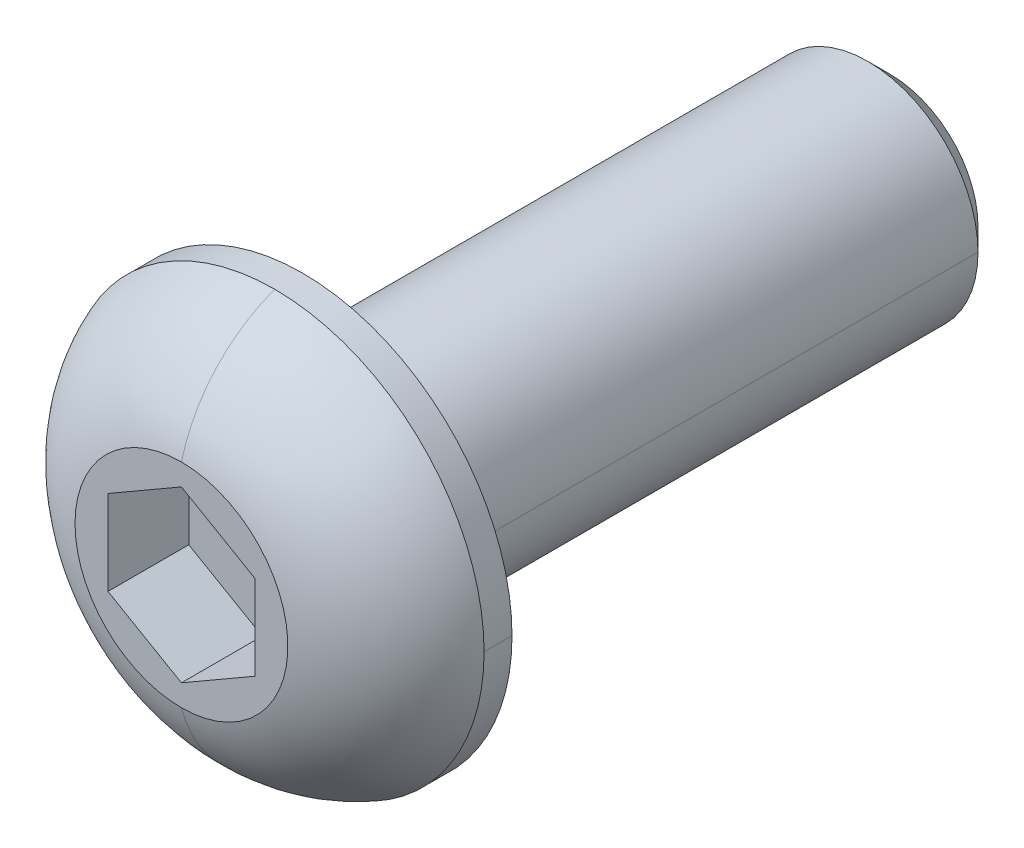
ISO-10303-21;
HEADER;
FILE_DESCRIPTION(('STEP AP214'),'2;1');
FILE_NAME('part.step','',(''),(''),'','','');
FILE_SCHEMA(('AUTOMOTIVE_DESIGN { 1 0 10303 214 1 1 1 1 }'));
ENDSEC;
DATA;
#1=APPLICATION_CONTEXT('core data for automotive mechanical design processes');
#2=APPLICATION_PROTOCOL_DEFINITION('international standard','automotive_design',2000,#1);
#3=PRODUCT_CONTEXT('',#1,'mechanical');
#4=PRODUCT('Part','Part','',(#3));
#5=PRODUCT_RELATED_PRODUCT_CATEGORY('part','',(#4));
#6=PRODUCT_DEFINITION_FORMATION('','',#4);
#7=PRODUCT_DEFINITION_CONTEXT('part definition',#1,'design');
#8=PRODUCT_DEFINITION('design','',#6,#7);
#9=PRODUCT_DEFINITION_SHAPE('','',#8);
#10=(LENGTH_UNIT() NAMED_UNIT(*) SI_UNIT(.MILLI.,.METRE.));
#11=(NAMED_UNIT(*) PLANE_ANGLE_UNIT() SI_UNIT($,.RADIAN.));
#12=(NAMED_UNIT(*) SI_UNIT($,.STERADIAN.) SOLID_ANGLE_UNIT());
#13=UNCERTAINTY_MEASURE_WITH_UNIT(LENGTH_MEASURE(1.E-05),#10,'distance_accuracy_value','');
#14=(GEOMETRIC_REPRESENTATION_CONTEXT(3) GLOBAL_UNCERTAINTY_ASSIGNED_CONTEXT((#13)) GLOBAL_UNIT_ASSIGNED_CONTEXT((#10,
#11,#12)) REPRESENTATION_CONTEXT('',''));
#15=CARTESIAN_POINT('',(0.,0.,0.));
#16=DIRECTION('',(0.,0.,1.));
#17=DIRECTION('',(1.,0.,0.));
#18=AXIS2_PLACEMENT_3D('',#15,#16,#17);
#19=CARTESIAN_POINT('',(0.,0.,1.05115163103287));
#20=DIRECTION('',(0.,0.,-1.));
#21=DIRECTION('',(-1.,0.,0.));
#22=AXIS2_PLACEMENT_3D('',#19,#20,#21);
#23=CYLINDRICAL_SURFACE('',#22,3.79999999998519);
#24=DIRECTION('',(0.,0.,-1.));
#25=VECTOR('',#24,1.);
#26=CARTESIAN_POINT('',(-3.79999999998519,0.,1.05115163103287));
#27=LINE('',#26,#25);
#28=CARTESIAN_POINT('',(-3.79999999997037,0.,1.3044849643733));
#29=VERTEX_POINT('',#28);
#30=CARTESIAN_POINT('',(-3.8,0.,0.797818297692444));
#31=VERTEX_POINT('',#30);
#32=EDGE_CURVE('E54',#29,#31,#27,.T.);
#33=ORIENTED_EDGE('',*,*,#32,.F.);
#34=CARTESIAN_POINT('',(0.,0.,1.3044849643733));
#35=DIRECTION('',(0.,0.,-1.));
#36=DIRECTION('',(-1.,0.,0.));
#37=AXIS2_PLACEMENT_3D('',#34,#35,#36);
#38=CIRCLE('',#37,3.79999999997037);
#39=CARTESIAN_POINT('',(0.,3.79999999997037,1.3044849643733));
#40=VERTEX_POINT('',#39);
#41=EDGE_CURVE('E11',#29,#40,#38,.T.);
#42=ORIENTED_EDGE('',*,*,#41,.T.);
#43=CARTESIAN_POINT('',(0.,0.,1.3044849643733));
#44=DIRECTION('',(0.,0.,-1.));
#45=DIRECTION('',(-1.,0.,0.));
#46=AXIS2_PLACEMENT_3D('',#43,#44,#45);
#47=CIRCLE('',#46,3.79999999997037);
#48=CARTESIAN_POINT('',(3.79999999997037,0.,1.3044849643733));
#49=VERTEX_POINT('',#48);
#50=EDGE_CURVE('E46',#40,#49,#47,.T.);
#51=ORIENTED_EDGE('',*,*,#50,.T.);
#52=DIRECTION('',(0.,0.,1.));
#53=VECTOR('',#52,1.);
#54=CARTESIAN_POINT('',(3.79999999998519,0.,1.05115163103287));
#55=LINE('',#54,#53);
#56=CARTESIAN_POINT('',(3.8,0.,0.797818297692445));
#57=VERTEX_POINT('',#56);
#58=EDGE_CURVE('E143',#57,#49,#55,.T.);
#59=ORIENTED_EDGE('',*,*,#58,.F.);
#60=CARTESIAN_POINT('',(0.,0.,0.797818297692445));
#61=DIRECTION('',(0.,0.,-1.));
#62=DIRECTION('',(-1.,0.,0.));
#63=AXIS2_PLACEMENT_3D('',#60,#61,#62);
#64=CIRCLE('',#63,3.8);
#65=EDGE_CURVE('E214',#31,#57,#64,.T.);
#66=ORIENTED_EDGE('',*,*,#65,.F.);
#67=EDGE_LOOP('',(#33,#42,#51,#59,#66));
#68=FACE_BOUND('',#67,.T.);
#69=ADVANCED_FACE('F36',(#68),#23,.T.);
#70=CARTESIAN_POINT('',(0.,0.,0.380310152090413));
#71=DIRECTION('',(0.,0.,-1.));
#72=DIRECTION('',(0.,-1.,0.));
#73=AXIS2_PLACEMENT_3D('',#70,#71,#72);
#74=DEGENERATE_TOROIDAL_SURFACE('',#73,1.26085057159698,2.7021063826702,.T.);
#75=CARTESIAN_POINT('',(0.,-1.26085057159698,0.380310152090413));
#76=DIRECTION('',(1.,0.,0.));
#77=DIRECTION('',(0.,-1.,0.));
#78=AXIS2_PLACEMENT_3D('',#75,#76,#77);
#79=CIRCLE('',#78,2.7021063826702);
#80=CARTESIAN_POINT('',(0.,-1.93169333333333,2.99781829769244));
#81=VERTEX_POINT('',#80);
#82=CARTESIAN_POINT('',(0.,-3.79999999997037,1.3044849643733));
#83=VERTEX_POINT('',#82);
#84=EDGE_CURVE('E198',#81,#83,#79,.T.);
#85=ORIENTED_EDGE('',*,*,#84,.F.);
#86=CARTESIAN_POINT('',(0.,0.,2.99781829769244));
#87=DIRECTION('',(0.,0.,-1.));
#88=DIRECTION('',(-1.,0.,0.));
#89=AXIS2_PLACEMENT_3D('',#86,#87,#88);
#90=CIRCLE('',#89,1.93169333333333);
#91=CARTESIAN_POINT('',(-1.93169333333333,0.,2.99781829769244));
#92=VERTEX_POINT('',#91);
#93=EDGE_CURVE('E208',#81,#92,#90,.T.);
#94=ORIENTED_EDGE('',*,*,#93,.T.);
#95=CARTESIAN_POINT('',(0.,0.,2.99781829769244));
#96=DIRECTION('',(0.,0.,-1.));
#97=DIRECTION('',(-1.,0.,0.));
#98=AXIS2_PLACEMENT_3D('',#95,#96,#97);
#99=CIRCLE('',#98,1.93169333333333);
#100=CARTESIAN_POINT('',(0.,1.93169333333333,2.99781829769244));
#101=VERTEX_POINT('',#100);
#102=EDGE_CURVE('E189',#92,#101,#99,.T.);
#103=ORIENTED_EDGE('',*,*,#102,.T.);
#104=CARTESIAN_POINT('',(0.,1.26085057159698,0.380310152090413));
#105=DIRECTION('',(1.,0.,0.));
#106=DIRECTION('',(0.,1.,0.));
#107=AXIS2_PLACEMENT_3D('',#104,#105,#106);
#108=CIRCLE('',#107,2.7021063826702);
#109=EDGE_CURVE('E226',#40,#101,#108,.T.);
#110=ORIENTED_EDGE('',*,*,#109,.F.);
#111=ORIENTED_EDGE('',*,*,#41,.F.);
#112=CARTESIAN_POINT('',(0.,0.,1.3044849643733));
#113=DIRECTION('',(0.,0.,-1.));
#114=DIRECTION('',(-1.,0.,0.));
#115=AXIS2_PLACEMENT_3D('',#112,#113,#114);
#116=CIRCLE('',#115,3.79999999997037);
#117=EDGE_CURVE('E223',#83,#29,#116,.T.);
#118=ORIENTED_EDGE('',*,*,#117,.F.);
#119=EDGE_LOOP('',(#85,#94,#103,#110,#111,#118));
#120=FACE_BOUND('',#119,.T.);
#121=ADVANCED_FACE('F307',(#120),#74,.T.);
#122=CARTESIAN_POINT('',(0.,0.,-9.66438170230755));
#123=DIRECTION('',(0.,0.,1.));
#124=DIRECTION('',(-1.,0.,0.));
#125=AXIS2_PLACEMENT_3D('',#122,#123,#124);
#126=CONICAL_SURFACE('',#125,1.79553333333333,0.785398163397448);
#127=DIRECTION('',(0.707106781186547,0.,-0.707106781186548));
#128=VECTOR('',#127,1.);
#129=CARTESIAN_POINT('',(-1.79553333333333,0.,-9.66438170230755));
#130=LINE('',#129,#128);
#131=CARTESIAN_POINT('',(-2.,0.,-9.45991503564089));
#132=VERTEX_POINT('',#131);
#133=CARTESIAN_POINT('',(-1.59106666666667,0.,-9.86884836897422));
#134=VERTEX_POINT('',#133);
#135=EDGE_CURVE('E195',#132,#134,#130,.T.);
#136=ORIENTED_EDGE('',*,*,#135,.F.);
#137=CARTESIAN_POINT('',(0.,0.,-9.45991503564089));
#138=DIRECTION('',(0.,0.,-1.));
#139=DIRECTION('',(-1.,0.,0.));
#140=AXIS2_PLACEMENT_3D('',#137,#138,#139);
#141=CIRCLE('',#140,2.);
#142=CARTESIAN_POINT('',(2.,0.,-9.45991503564089));
#143=VERTEX_POINT('',#142);
#144=EDGE_CURVE('E186',#132,#143,#141,.T.);
#145=ORIENTED_EDGE('',*,*,#144,.T.);
#146=DIRECTION('',(0.707106781186547,0.,0.707106781186548));
#147=VECTOR('',#146,1.);
#148=CARTESIAN_POINT('',(1.79553333333333,0.,-9.66438170230755));
#149=LINE('',#148,#147);
#150=CARTESIAN_POINT('',(1.59106666666667,0.,-9.86884836897422));
#151=VERTEX_POINT('',#150);
#152=EDGE_CURVE('E219',#151,#143,#149,.T.);
#153=ORIENTED_EDGE('',*,*,#152,.F.);
#154=CARTESIAN_POINT('',(0.,0.,-9.86884836897422));
#155=DIRECTION('',(0.,0.,-1.));
#156=DIRECTION('',(-1.,0.,0.));
#157=AXIS2_PLACEMENT_3D('',#154,#155,#156);
#158=CIRCLE('',#157,1.59106666666667);
#159=EDGE_CURVE('E220',#134,#151,#158,.T.);
#160=ORIENTED_EDGE('',*,*,#159,.F.);
#161=EDGE_LOOP('',(#136,#145,#153,#160));
#162=FACE_BOUND('',#161,.T.);
#163=ADVANCED_FACE('F327',(#162),#126,.T.);
#164=CARTESIAN_POINT('',(0.,0.,-4.39771503564089));
#165=DIRECTION('',(0.,0.,-1.));
#166=DIRECTION('',(-1.,0.,0.));
#167=AXIS2_PLACEMENT_3D('',#164,#165,#166);
#168=CYLINDRICAL_SURFACE('',#167,2.);
#169=DIRECTION('',(0.,0.,-1.));
#170=VECTOR('',#169,1.);
#171=CARTESIAN_POINT('',(-2.,0.,-4.39771503564089));
#172=LINE('',#171,#170);
#173=CARTESIAN_POINT('',(-2.,0.,0.664484964359111));
#174=VERTEX_POINT('',#173);
#175=EDGE_CURVE('E249',#174,#132,#172,.T.);
#176=ORIENTED_EDGE('',*,*,#175,.F.);
#177=CARTESIAN_POINT('',(0.,0.,0.664484964359111));
#178=DIRECTION('',(0.,0.,-1.));
#179=DIRECTION('',(-1.,0.,0.));
#180=AXIS2_PLACEMENT_3D('',#177,#178,#179);
#181=CIRCLE('',#180,2.);
#182=CARTESIAN_POINT('',(0.,2.,0.664484964359111));
#183=VERTEX_POINT('',#182);
#184=EDGE_CURVE('E190',#174,#183,#181,.T.);
#185=ORIENTED_EDGE('',*,*,#184,.T.);
#186=CARTESIAN_POINT('',(0.,0.,0.664484964359111));
#187=DIRECTION('',(0.,0.,-1.));
#188=DIRECTION('',(-1.,0.,0.));
#189=AXIS2_PLACEMENT_3D('',#186,#187,#188);
#190=CIRCLE('',#189,2.);
#191=CARTESIAN_POINT('',(2.,0.,0.664484964359111));
#192=VERTEX_POINT('',#191);
#193=EDGE_CURVE('E40',#183,#192,#190,.T.);
#194=ORIENTED_EDGE('',*,*,#193,.T.);
#195=DIRECTION('',(0.,0.,1.));
#196=VECTOR('',#195,1.);
#197=CARTESIAN_POINT('',(2.,0.,-4.39771503564089));
#198=LINE('',#197,#196);
#199=EDGE_CURVE('E81',#143,#192,#198,.T.);
#200=ORIENTED_EDGE('',*,*,#199,.F.);
#201=ORIENTED_EDGE('',*,*,#144,.F.);
#202=EDGE_LOOP('',(#176,#185,#194,#200,#201));
#203=FACE_BOUND('',#202,.T.);
#204=ADVANCED_FACE('F334',(#203),#168,.T.);
#205=CARTESIAN_POINT('',(0.,0.,0.664484964359111));
#206=DIRECTION('',(0.,0.,-1.));
#207=DIRECTION('',(0.,-1.,0.));
#208=AXIS2_PLACEMENT_3D('',#205,#206,#207);
#209=TOROIDAL_SURFACE('',#208,2.13333333333333,0.133333333333333);
#210=CARTESIAN_POINT('',(0.,2.13333333333333,0.664484964359111));
#211=DIRECTION('',(1.,0.,0.));
#212=DIRECTION('',(0.,1.,0.));
#213=AXIS2_PLACEMENT_3D('',#210,#211,#212);
#214=CIRCLE('',#213,0.133333333333333);
#215=CARTESIAN_POINT('',(0.,2.13333333333333,0.797818297692445));
#216=VERTEX_POINT('',#215);
#217=EDGE_CURVE('E215',#216,#183,#214,.T.);
#218=ORIENTED_EDGE('',*,*,#217,.F.);
#219=CARTESIAN_POINT('',(0.,0.,0.797818297692445));
#220=DIRECTION('',(0.,0.,-1.));
#221=DIRECTION('',(-1.,0.,0.));
#222=AXIS2_PLACEMENT_3D('',#219,#220,#221);
#223=CIRCLE('',#222,2.13333333333333);
#224=CARTESIAN_POINT('',(0.,-2.13333333333333,0.797818297692445));
#225=VERTEX_POINT('',#224);
#226=EDGE_CURVE('E262',#216,#225,#223,.T.);
#227=ORIENTED_EDGE('',*,*,#226,.T.);
#228=CARTESIAN_POINT('',(0.,-2.13333333333333,0.664484964359111));
#229=DIRECTION('',(1.,0.,0.));
#230=DIRECTION('',(0.,-1.,0.));
#231=AXIS2_PLACEMENT_3D('',#228,#229,#230);
#232=CIRCLE('',#231,0.133333333333333);
#233=CARTESIAN_POINT('',(0.,-2.,0.664484964359111));
#234=VERTEX_POINT('',#233);
#235=EDGE_CURVE('E183',#234,#225,#232,.T.);
#236=ORIENTED_EDGE('',*,*,#235,.F.);
#237=CARTESIAN_POINT('',(0.,0.,0.664484964359111));
#238=DIRECTION('',(0.,0.,-1.));
#239=DIRECTION('',(-1.,0.,0.));
#240=AXIS2_PLACEMENT_3D('',#237,#238,#239);
#241=CIRCLE('',#240,2.);
#242=EDGE_CURVE('E194',#192,#234,#241,.T.);
#243=ORIENTED_EDGE('',*,*,#242,.F.);
#244=ORIENTED_EDGE('',*,*,#193,.F.);
#245=EDGE_LOOP('',(#218,#227,#236,#243,#244));
#246=FACE_BOUND('',#245,.T.);
#247=ADVANCED_FACE('F349',(#246),#209,.F.);
#248=CARTESIAN_POINT('',(1.33333333333333,0.384900179466667,2.99781829769244));
#249=DIRECTION('',(1.,0.,0.));
#250=DIRECTION('',(0.,1.,0.));
#251=AXIS2_PLACEMENT_3D('',#248,#249,#250);
#252=PLANE('',#251);
#253=DIRECTION('',(0.,1.,0.));
#254=VECTOR('',#253,1.);
#255=CARTESIAN_POINT('',(1.33333333333333,0.,1.53115163102578));
#256=LINE('',#255,#254);
#257=CARTESIAN_POINT('',(1.33333333333333,-0.769800358933333,1.53115163102578));
#258=VERTEX_POINT('',#257);
#259=CARTESIAN_POINT('',(1.33333333333333,0.769800358933333,1.53115163102578));
#260=VERTEX_POINT('',#259);
#261=EDGE_CURVE('E169',#258,#260,#256,.T.);
#262=ORIENTED_EDGE('',*,*,#261,.F.);
#263=DIRECTION('',(0.,0.,-1.));
#264=VECTOR('',#263,1.);
#265=CARTESIAN_POINT('',(1.33333333333333,-0.769800358933333,2.99781829769244));
#266=LINE('',#265,#264);
#267=CARTESIAN_POINT('',(1.33333333333333,-0.769800358933333,2.99781829769244));
#268=VERTEX_POINT('',#267);
#269=EDGE_CURVE('E168',#268,#258,#266,.T.);
#270=ORIENTED_EDGE('',*,*,#269,.F.);
#271=DIRECTION('',(0.,-1.,0.));
#272=VECTOR('',#271,1.);
#273=CARTESIAN_POINT('',(1.33333333333333,0.192450089733333,2.99781829769244));
#274=LINE('',#273,#272);
#275=CARTESIAN_POINT('',(1.33333333333333,0.769800358933333,2.99781829769244));
#276=VERTEX_POINT('',#275);
#277=EDGE_CURVE('E157',#276,#268,#274,.T.);
#278=ORIENTED_EDGE('',*,*,#277,.F.);
#279=DIRECTION('',(0.,0.,-1.));
#280=VECTOR('',#279,1.);
#281=CARTESIAN_POINT('',(1.33333333333333,0.769800358933333,2.99781829769244));
#282=LINE('',#281,#280);
#283=EDGE_CURVE('E260',#276,#260,#282,.T.);
#284=ORIENTED_EDGE('',*,*,#283,.T.);
#285=EDGE_LOOP('',(#262,#270,#278,#284));
#286=FACE_BOUND('',#285,.T.);
#287=ADVANCED_FACE('F38',(#286),#252,.F.);
#288=CARTESIAN_POINT('',(0.666666666666667,1.1547005384,2.99781829769244));
#289=DIRECTION('',(0.500000000006738,0.866025403780548,0.));
#290=DIRECTION('',(0.,0.,-1.));
#291=AXIS2_PLACEMENT_3D('',#288,#289,#290);
#292=PLANE('',#291);
#293=DIRECTION('',(-0.866025403780548,0.500000000006738,0.));
#294=VECTOR('',#293,1.);
#295=CARTESIAN_POINT('',(0.,1.53960071786667,1.53115163102578));
#296=LINE('',#295,#294);
#297=CARTESIAN_POINT('',(0.,1.53960071786667,1.53115163102578));
#298=VERTEX_POINT('',#297);
#299=EDGE_CURVE('E116',#260,#298,#296,.T.);
#300=ORIENTED_EDGE('',*,*,#299,.F.);
#301=ORIENTED_EDGE('',*,*,#283,.F.);
#302=DIRECTION('',(0.866025403780548,-0.500000000006738,0.));
#303=VECTOR('',#302,1.);
#304=CARTESIAN_POINT('',(0.0169741666814883,1.52980067816367,2.99781829769244));
#305=LINE('',#304,#303);
#306=CARTESIAN_POINT('',(0.,1.53960071786667,2.99781829769244));
#307=VERTEX_POINT('',#306);
#308=EDGE_CURVE('E124',#307,#276,#305,.T.);
#309=ORIENTED_EDGE('',*,*,#308,.F.);
#310=DIRECTION('',(0.,0.,-1.));
#311=VECTOR('',#310,1.);
#312=CARTESIAN_POINT('',(0.,1.53960071786667,2.99781829769244));
#313=LINE('',#312,#311);
#314=EDGE_CURVE('E236',#307,#298,#313,.T.);
#315=ORIENTED_EDGE('',*,*,#314,.T.);
#316=EDGE_LOOP('',(#300,#301,#309,#315));
#317=FACE_BOUND('',#316,.T.);
#318=ADVANCED_FACE('F422',(#317),#292,.F.);
#319=CARTESIAN_POINT('',(-0.666666666666667,1.1547005384,2.99781829769244));
#320=DIRECTION('',(-0.500000000006738,0.866025403780548,0.));
#321=DIRECTION('',(0.,0.,1.));
#322=AXIS2_PLACEMENT_3D('',#319,#320,#321);
#323=PLANE('',#322);
#324=DIRECTION('',(-0.866025403780548,-0.500000000006738,0.));
#325=VECTOR('',#324,1.);
#326=CARTESIAN_POINT('',(-1.33333333333333,0.769800358933333,1.53115163102578));
#327=LINE('',#326,#325);
#328=CARTESIAN_POINT('',(-1.33333333333333,0.769800358933333,1.53115163102578));
#329=VERTEX_POINT('',#328);
#330=EDGE_CURVE('E200',#298,#329,#327,.T.);
#331=ORIENTED_EDGE('',*,*,#330,.F.);
#332=ORIENTED_EDGE('',*,*,#314,.F.);
#333=DIRECTION('',(0.866025403780548,0.500000000006738,0.));
#334=VECTOR('',#333,1.);
#335=CARTESIAN_POINT('',(-1.31635916666981,0.779600398625961,2.99781829769244));
#336=LINE('',#335,#334);
#337=CARTESIAN_POINT('',(-1.33333333333333,0.769800358933333,2.99781829769244));
#338=VERTEX_POINT('',#337);
#339=EDGE_CURVE('E197',#338,#307,#336,.T.);
#340=ORIENTED_EDGE('',*,*,#339,.F.);
#341=DIRECTION('',(0.,0.,-1.));
#342=VECTOR('',#341,1.);
#343=CARTESIAN_POINT('',(-1.33333333333333,0.769800358933333,2.99781829769244));
#344=LINE('',#343,#342);
#345=EDGE_CURVE('E238',#338,#329,#344,.T.);
#346=ORIENTED_EDGE('',*,*,#345,.T.);
#347=EDGE_LOOP('',(#331,#332,#340,#346));
#348=FACE_BOUND('',#347,.T.);
#349=ADVANCED_FACE('F415',(#348),#323,.F.);
#350=CARTESIAN_POINT('',(-1.33333333333333,0.,2.99781829769244));
#351=DIRECTION('',(-1.,0.,0.));
#352=DIRECTION('',(0.,0.,1.));
#353=AXIS2_PLACEMENT_3D('',#350,#351,#352);
#354=PLANE('',#353);
#355=DIRECTION('',(0.,-1.,0.));
#356=VECTOR('',#355,1.);
#357=CARTESIAN_POINT('',(-1.33333333333333,-0.769800358933333,1.53115163102578));
#358=LINE('',#357,#356);
#359=CARTESIAN_POINT('',(-1.33333333333333,-0.769800358933333,1.53115163102578));
#360=VERTEX_POINT('',#359);
#361=EDGE_CURVE('E201',#329,#360,#358,.T.);
#362=ORIENTED_EDGE('',*,*,#361,.F.);
#363=ORIENTED_EDGE('',*,*,#345,.F.);
#364=DIRECTION('',(0.,1.,0.));
#365=VECTOR('',#364,1.);
#366=CARTESIAN_POINT('',(-1.33333333333333,0.,2.99781829769244));
#367=LINE('',#366,#365);
#368=CARTESIAN_POINT('',(-1.33333333333333,-0.769800358933333,2.99781829769244));
#369=VERTEX_POINT('',#368);
#370=EDGE_CURVE('E180',#369,#338,#367,.T.);
#371=ORIENTED_EDGE('',*,*,#370,.F.);
#372=DIRECTION('',(0.,0.,-1.));
#373=VECTOR('',#372,1.);
#374=CARTESIAN_POINT('',(-1.33333333333333,-0.769800358933333,2.99781829769244));
#375=LINE('',#374,#373);
#376=EDGE_CURVE('E205',#369,#360,#375,.T.);
#377=ORIENTED_EDGE('',*,*,#376,.T.);
#378=EDGE_LOOP('',(#362,#363,#371,#377));
#379=FACE_BOUND('',#378,.T.);
#380=ADVANCED_FACE('F291',(#379),#354,.F.);
#381=CARTESIAN_POINT('',(-0.666666666666667,-1.1547005384,2.99781829769244));
#382=DIRECTION('',(-0.500000000006738,-0.866025403780548,0.));
#383=DIRECTION('',(-0.866025403780548,0.500000000006738,0.));
#384=AXIS2_PLACEMENT_3D('',#381,#382,#383);
#385=PLANE('',#384);
#386=DIRECTION('',(0.866025403780548,-0.500000000006738,0.));
#387=VECTOR('',#386,1.);
#388=CARTESIAN_POINT('',(0.,-1.53960071786667,1.53115163102578));
#389=LINE('',#388,#387);
#390=CARTESIAN_POINT('',(0.,-1.53960071786667,1.53115163102578));
#391=VERTEX_POINT('',#390);
#392=EDGE_CURVE('E203',#360,#391,#389,.T.);
#393=ORIENTED_EDGE('',*,*,#392,.F.);
#394=ORIENTED_EDGE('',*,*,#376,.F.);
#395=DIRECTION('',(-0.866025403780548,0.500000000006738,0.));
#396=VECTOR('',#395,1.);
#397=CARTESIAN_POINT('',(-1.31635916666981,-0.779600398625961,2.99781829769244));
#398=LINE('',#397,#396);
#399=CARTESIAN_POINT('',(0.,-1.53960071786667,2.99781829769244));
#400=VERTEX_POINT('',#399);
#401=EDGE_CURVE('E178',#400,#369,#398,.T.);
#402=ORIENTED_EDGE('',*,*,#401,.F.);
#403=DIRECTION('',(0.,0.,-1.));
#404=VECTOR('',#403,1.);
#405=CARTESIAN_POINT('',(0.,-1.53960071786667,2.99781829769244));
#406=LINE('',#405,#404);
#407=EDGE_CURVE('E173',#400,#391,#406,.T.);
#408=ORIENTED_EDGE('',*,*,#407,.T.);
#409=EDGE_LOOP('',(#393,#394,#402,#408));
#410=FACE_BOUND('',#409,.T.);
#411=ADVANCED_FACE('F295',(#410),#385,.F.);
#412=CARTESIAN_POINT('',(0.666666666666667,-1.1547005384,2.99781829769244));
#413=DIRECTION('',(0.500000000006738,-0.866025403780548,0.));
#414=DIRECTION('',(0.,0.,-1.));
#415=AXIS2_PLACEMENT_3D('',#412,#413,#414);
#416=PLANE('',#415);
#417=DIRECTION('',(0.866025403780548,0.500000000006738,0.));
#418=VECTOR('',#417,1.);
#419=CARTESIAN_POINT('',(1.33333333333333,-0.769800358933333,1.53115163102578));
#420=LINE('',#419,#418);
#421=EDGE_CURVE('E241',#391,#258,#420,.T.);
#422=ORIENTED_EDGE('',*,*,#421,.F.);
#423=ORIENTED_EDGE('',*,*,#407,.F.);
#424=DIRECTION('',(-0.866025403780548,-0.500000000006738,0.));
#425=VECTOR('',#424,1.);
#426=CARTESIAN_POINT('',(0.0169741666814881,-1.52980067816367,2.99781829769244));
#427=LINE('',#426,#425);
#428=EDGE_CURVE('E163',#268,#400,#427,.T.);
#429=ORIENTED_EDGE('',*,*,#428,.F.);
#430=ORIENTED_EDGE('',*,*,#269,.T.);
#431=EDGE_LOOP('',(#422,#423,#429,#430));
#432=FACE_BOUND('',#431,.T.);
#433=ADVANCED_FACE('F176',(#432),#416,.F.);
#434=CARTESIAN_POINT('',(0.,0.,1.53115163102578));
#435=DIRECTION('',(0.,0.,-1.));
#436=DIRECTION('',(0.,-1.,0.));
#437=AXIS2_PLACEMENT_3D('',#434,#435,#436);
#438=PLANE('',#437);
#439=ORIENTED_EDGE('',*,*,#261,.T.);
#440=ORIENTED_EDGE('',*,*,#299,.T.);
#441=ORIENTED_EDGE('',*,*,#330,.T.);
#442=ORIENTED_EDGE('',*,*,#361,.T.);
#443=ORIENTED_EDGE('',*,*,#392,.T.);
#444=ORIENTED_EDGE('',*,*,#421,.T.);
#445=EDGE_LOOP('',(#439,#440,#441,#442,#443,#444));
#446=FACE_BOUND('',#445,.T.);
#447=ADVANCED_FACE('F296',(#446),#438,.F.);
#448=CARTESIAN_POINT('',(-2.96666666666667,0.,0.797818297692445));
#449=DIRECTION('',(0.,0.,-1.));
#450=DIRECTION('',(0.,-1.,0.));
#451=AXIS2_PLACEMENT_3D('',#448,#449,#450);
#452=PLANE('',#451);
#453=ORIENTED_EDGE('',*,*,#65,.T.);
#454=CARTESIAN_POINT('',(0.,0.,0.797818297692445));
#455=DIRECTION('',(0.,0.,-1.));
#456=DIRECTION('',(-1.,0.,0.));
#457=AXIS2_PLACEMENT_3D('',#454,#455,#456);
#458=CIRCLE('',#457,3.8);
#459=EDGE_CURVE('E211',#57,#31,#458,.T.);
#460=ORIENTED_EDGE('',*,*,#459,.T.);
#461=EDGE_LOOP('',(#453,#460));
#462=FACE_BOUND('',#461,.T.);
#463=CARTESIAN_POINT('',(0.,0.,0.797818297692445));
#464=DIRECTION('',(0.,0.,-1.));
#465=DIRECTION('',(-1.,0.,0.));
#466=AXIS2_PLACEMENT_3D('',#463,#464,#465);
#467=CIRCLE('',#466,2.13333333333333);
#468=CARTESIAN_POINT('',(-2.13333333333333,0.,0.797818297692445));
#469=VERTEX_POINT('',#468);
#470=EDGE_CURVE('E246',#469,#216,#467,.T.);
#471=ORIENTED_EDGE('',*,*,#470,.F.);
#472=CARTESIAN_POINT('',(0.,0.,0.797818297692445));
#473=DIRECTION('',(0.,0.,-1.));
#474=DIRECTION('',(-1.,0.,0.));
#475=AXIS2_PLACEMENT_3D('',#472,#473,#474);
#476=CIRCLE('',#475,2.13333333333333);
#477=EDGE_CURVE('E243',#225,#469,#476,.T.);
#478=ORIENTED_EDGE('',*,*,#477,.F.);
#479=ORIENTED_EDGE('',*,*,#226,.F.);
#480=EDGE_LOOP('',(#471,#478,#479));
#481=FACE_BOUND('',#480,.T.);
#482=ADVANCED_FACE('F342',(#462,#481),#452,.T.);
#483=CARTESIAN_POINT('',(0.,0.,0.664484964359111));
#484=DIRECTION('',(0.,0.,-1.));
#485=DIRECTION('',(0.,-1.,0.));
#486=AXIS2_PLACEMENT_3D('',#483,#484,#485);
#487=TOROIDAL_SURFACE('',#486,2.13333333333333,0.133333333333333);
#488=ORIENTED_EDGE('',*,*,#217,.T.);
#489=ORIENTED_EDGE('',*,*,#184,.F.);
#490=CARTESIAN_POINT('',(0.,0.,0.664484964359111));
#491=DIRECTION('',(0.,0.,-1.));
#492=DIRECTION('',(-1.,0.,0.));
#493=AXIS2_PLACEMENT_3D('',#490,#491,#492);
#494=CIRCLE('',#493,2.);
#495=EDGE_CURVE('E191',#234,#174,#494,.T.);
#496=ORIENTED_EDGE('',*,*,#495,.F.);
#497=ORIENTED_EDGE('',*,*,#235,.T.);
#498=ORIENTED_EDGE('',*,*,#477,.T.);
#499=ORIENTED_EDGE('',*,*,#470,.T.);
#500=EDGE_LOOP('',(#488,#489,#496,#497,#498,#499));
#501=FACE_BOUND('',#500,.T.);
#502=ADVANCED_FACE('F343',(#501),#487,.F.);
#503=CARTESIAN_POINT('',(0.,0.,-4.39771503564089));
#504=DIRECTION('',(0.,0.,-1.));
#505=DIRECTION('',(-1.,0.,0.));
#506=AXIS2_PLACEMENT_3D('',#503,#504,#505);
#507=CYLINDRICAL_SURFACE('',#506,2.);
#508=ORIENTED_EDGE('',*,*,#175,.T.);
#509=CARTESIAN_POINT('',(0.,0.,-9.45991503564089));
#510=DIRECTION('',(0.,0.,-1.));
#511=DIRECTION('',(-1.,0.,0.));
#512=AXIS2_PLACEMENT_3D('',#509,#510,#511);
#513=CIRCLE('',#512,2.);
#514=EDGE_CURVE('E216',#143,#132,#513,.T.);
#515=ORIENTED_EDGE('',*,*,#514,.F.);
#516=ORIENTED_EDGE('',*,*,#199,.T.);
#517=ORIENTED_EDGE('',*,*,#242,.T.);
#518=ORIENTED_EDGE('',*,*,#495,.T.);
#519=EDGE_LOOP('',(#508,#515,#516,#517,#518));
#520=FACE_BOUND('',#519,.T.);
#521=ADVANCED_FACE('F337',(#520),#507,.T.);
#522=CARTESIAN_POINT('',(0.,0.,-9.66438170230755));
#523=DIRECTION('',(0.,0.,1.));
#524=DIRECTION('',(-1.,0.,0.));
#525=AXIS2_PLACEMENT_3D('',#522,#523,#524);
#526=CONICAL_SURFACE('',#525,1.79553333333333,0.785398163397448);
#527=ORIENTED_EDGE('',*,*,#135,.T.);
#528=CARTESIAN_POINT('',(0.,0.,-9.86884836897422));
#529=DIRECTION('',(0.,0.,-1.));
#530=DIRECTION('',(-1.,0.,0.));
#531=AXIS2_PLACEMENT_3D('',#528,#529,#530);
#532=CIRCLE('',#531,1.59106666666667);
#533=EDGE_CURVE('E165',#151,#134,#532,.T.);
#534=ORIENTED_EDGE('',*,*,#533,.F.);
#535=ORIENTED_EDGE('',*,*,#152,.T.);
#536=ORIENTED_EDGE('',*,*,#514,.T.);
#537=EDGE_LOOP('',(#527,#534,#535,#536));
#538=FACE_BOUND('',#537,.T.);
#539=ADVANCED_FACE('F272',(#538),#526,.T.);
#540=CARTESIAN_POINT('',(-0.795533333333333,0.,-9.86884836897422));
#541=DIRECTION('',(0.,0.,-1.));
#542=DIRECTION('',(0.,-1.,0.));
#543=AXIS2_PLACEMENT_3D('',#540,#541,#542);
#544=PLANE('',#543);
#545=ORIENTED_EDGE('',*,*,#159,.T.);
#546=ORIENTED_EDGE('',*,*,#533,.T.);
#547=EDGE_LOOP('',(#545,#546));
#548=FACE_BOUND('',#547,.T.);
#549=ADVANCED_FACE('F275',(#548),#544,.T.);
#550=CARTESIAN_POINT('',(-1.73251333333333,0.,2.99781829769244));
#551=DIRECTION('',(0.,0.,1.));
#552=DIRECTION('',(1.,0.,0.));
#553=AXIS2_PLACEMENT_3D('',#550,#551,#552);
#554=PLANE('',#553);
#555=ORIENTED_EDGE('',*,*,#102,.F.);
#556=ORIENTED_EDGE('',*,*,#93,.F.);
#557=CARTESIAN_POINT('',(0.,0.,2.99781829769244));
#558=DIRECTION('',(0.,0.,-1.));
#559=DIRECTION('',(-1.,0.,0.));
#560=AXIS2_PLACEMENT_3D('',#557,#558,#559);
#561=CIRCLE('',#560,1.93169333333333);
#562=EDGE_CURVE('E224',#101,#81,#561,.T.);
#563=ORIENTED_EDGE('',*,*,#562,.F.);
#564=EDGE_LOOP('',(#555,#556,#563));
#565=FACE_BOUND('',#564,.T.);
#566=ORIENTED_EDGE('',*,*,#277,.T.);
#567=ORIENTED_EDGE('',*,*,#428,.T.);
#568=ORIENTED_EDGE('',*,*,#401,.T.);
#569=ORIENTED_EDGE('',*,*,#370,.T.);
#570=ORIENTED_EDGE('',*,*,#339,.T.);
#571=ORIENTED_EDGE('',*,*,#308,.T.);
#572=EDGE_LOOP('',(#566,#567,#568,#569,#570,#571));
#573=FACE_BOUND('',#572,.T.);
#574=ADVANCED_FACE('F160',(#565,#573),#554,.T.);
#575=CARTESIAN_POINT('',(0.,0.,0.380310152090413));
#576=DIRECTION('',(0.,0.,-1.));
#577=DIRECTION('',(0.,-1.,0.));
#578=AXIS2_PLACEMENT_3D('',#575,#576,#577);
#579=DEGENERATE_TOROIDAL_SURFACE('',#578,1.26085057159698,2.7021063826702,.T.);
#580=ORIENTED_EDGE('',*,*,#84,.T.);
#581=CARTESIAN_POINT('',(0.,0.,1.3044849643733));
#582=DIRECTION('',(0.,0.,-1.));
#583=DIRECTION('',(-1.,0.,0.));
#584=AXIS2_PLACEMENT_3D('',#581,#582,#583);
#585=CIRCLE('',#584,3.79999999997037);
#586=EDGE_CURVE('E222',#49,#83,#585,.T.);
#587=ORIENTED_EDGE('',*,*,#586,.F.);
#588=ORIENTED_EDGE('',*,*,#50,.F.);
#589=ORIENTED_EDGE('',*,*,#109,.T.);
#590=ORIENTED_EDGE('',*,*,#562,.T.);
#591=EDGE_LOOP('',(#580,#587,#588,#589,#590));
#592=FACE_BOUND('',#591,.T.);
#593=ADVANCED_FACE('F311',(#592),#579,.T.);
#594=CARTESIAN_POINT('',(0.,0.,1.05115163103287));
#595=DIRECTION('',(0.,0.,-1.));
#596=DIRECTION('',(-1.,0.,0.));
#597=AXIS2_PLACEMENT_3D('',#594,#595,#596);
#598=CYLINDRICAL_SURFACE('',#597,3.79999999998519);
#599=ORIENTED_EDGE('',*,*,#32,.T.);
#600=ORIENTED_EDGE('',*,*,#459,.F.);
#601=ORIENTED_EDGE('',*,*,#58,.T.);
#602=ORIENTED_EDGE('',*,*,#586,.T.);
#603=ORIENTED_EDGE('',*,*,#117,.T.);
#604=EDGE_LOOP('',(#599,#600,#601,#602,#603));
#605=FACE_BOUND('',#604,.T.);
#606=ADVANCED_FACE('F317',(#605),#598,.T.);
#607=CLOSED_SHELL('',(#69,#121,#163,#204,#247,#287,#318,#349,#380,#411,#433,#447,#482,#502,#521,
#539,#549,#574,#593,#606));
#608=MANIFOLD_SOLID_BREP('B2',#607);
#609=ADVANCED_BREP_SHAPE_REPRESENTATION('',(#18,#608),#14);
#610=SHAPE_DEFINITION_REPRESENTATION(#9,#609);
ENDSEC;
END-ISO-10303-21;
